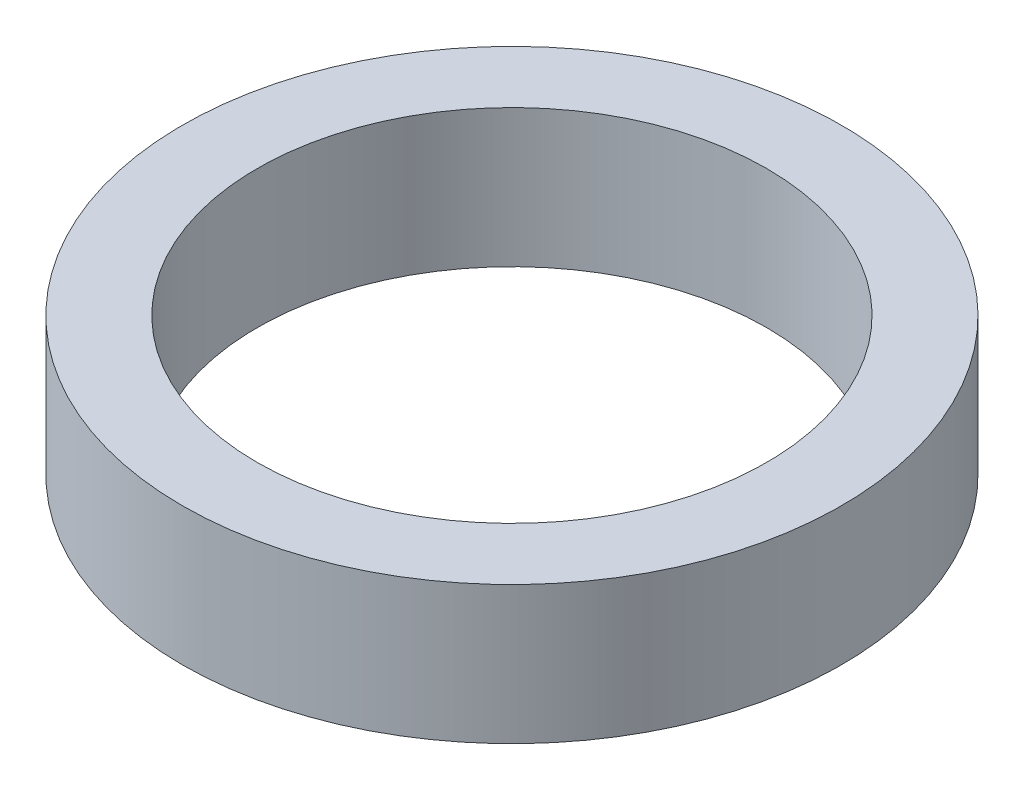
ISO-10303-21;
HEADER;
FILE_DESCRIPTION(('STEP AP214'),'2;1');
FILE_NAME('part.step','',(''),(''),'','','');
FILE_SCHEMA(('AUTOMOTIVE_DESIGN { 1 0 10303 214 1 1 1 1 }'));
ENDSEC;
DATA;
#1=APPLICATION_CONTEXT('core data for automotive mechanical design processes');
#2=APPLICATION_PROTOCOL_DEFINITION('international standard','automotive_design',2000,#1);
#3=PRODUCT_CONTEXT('',#1,'mechanical');
#4=PRODUCT('Part','Part','',(#3));
#5=PRODUCT_RELATED_PRODUCT_CATEGORY('part','',(#4));
#6=PRODUCT_DEFINITION_FORMATION('','',#4);
#7=PRODUCT_DEFINITION_CONTEXT('part definition',#1,'design');
#8=PRODUCT_DEFINITION('design','',#6,#7);
#9=PRODUCT_DEFINITION_SHAPE('','',#8);
#10=(LENGTH_UNIT() NAMED_UNIT(*) SI_UNIT(.MILLI.,.METRE.));
#11=(NAMED_UNIT(*) PLANE_ANGLE_UNIT() SI_UNIT($,.RADIAN.));
#12=(NAMED_UNIT(*) SI_UNIT($,.STERADIAN.) SOLID_ANGLE_UNIT());
#13=UNCERTAINTY_MEASURE_WITH_UNIT(LENGTH_MEASURE(1.E-05),#10,'distance_accuracy_value','');
#14=(GEOMETRIC_REPRESENTATION_CONTEXT(3) GLOBAL_UNCERTAINTY_ASSIGNED_CONTEXT((#13)) GLOBAL_UNIT_ASSIGNED_CONTEXT((#10,
#11,#12)) REPRESENTATION_CONTEXT('',''));
#15=CARTESIAN_POINT('',(0.,0.,0.));
#16=DIRECTION('',(0.,0.,1.));
#17=DIRECTION('',(1.,0.,0.));
#18=AXIS2_PLACEMENT_3D('',#15,#16,#17);
#19=CARTESIAN_POINT('',(0.,23.,0.));
#20=DIRECTION('',(0.,-1.,0.));
#21=DIRECTION('',(0.,0.,-1.));
#22=AXIS2_PLACEMENT_3D('',#19,#20,#21);
#23=CYLINDRICAL_SURFACE('',#22,55.);
#24=CARTESIAN_POINT('',(0.,23.,0.));
#25=DIRECTION('',(0.,1.,0.));
#26=DIRECTION('',(0.,0.,1.));
#27=AXIS2_PLACEMENT_3D('',#24,#25,#26);
#28=CIRCLE('',#27,55.);
#29=CARTESIAN_POINT('',(0.,23.,55.));
#30=VERTEX_POINT('',#29);
#31=EDGE_CURVE('E10',#30,#30,#28,.T.);
#32=ORIENTED_EDGE('',*,*,#31,.F.);
#33=EDGE_LOOP('',(#32));
#34=FACE_BOUND('',#33,.T.);
#35=CARTESIAN_POINT('',(0.,0.,0.));
#36=DIRECTION('',(0.,1.,0.));
#37=DIRECTION('',(0.,0.,1.));
#38=AXIS2_PLACEMENT_3D('',#35,#36,#37);
#39=CIRCLE('',#38,55.);
#40=CARTESIAN_POINT('',(0.,0.,55.));
#41=VERTEX_POINT('',#40);
#42=EDGE_CURVE('E37',#41,#41,#39,.T.);
#43=ORIENTED_EDGE('',*,*,#42,.T.);
#44=EDGE_LOOP('',(#43));
#45=FACE_BOUND('',#44,.T.);
#46=ADVANCED_FACE('F40',(#34,#45),#23,.T.);
#47=CARTESIAN_POINT('',(0.,23.,0.));
#48=DIRECTION('',(0.,1.,0.));
#49=DIRECTION('',(0.,0.,1.));
#50=AXIS2_PLACEMENT_3D('',#47,#48,#49);
#51=PLANE('',#50);
#52=CARTESIAN_POINT('',(0.,23.,0.));
#53=DIRECTION('',(0.,1.,0.));
#54=DIRECTION('',(0.,0.,1.));
#55=AXIS2_PLACEMENT_3D('',#52,#53,#54);
#56=CIRCLE('',#55,42.5);
#57=CARTESIAN_POINT('',(0.,23.,42.5));
#58=VERTEX_POINT('',#57);
#59=EDGE_CURVE('E50',#58,#58,#56,.T.);
#60=ORIENTED_EDGE('',*,*,#59,.F.);
#61=EDGE_LOOP('',(#60));
#62=FACE_BOUND('',#61,.T.);
#63=ORIENTED_EDGE('',*,*,#31,.T.);
#64=EDGE_LOOP('',(#63));
#65=FACE_BOUND('',#64,.T.);
#66=ADVANCED_FACE('F59',(#62,#65),#51,.T.);
#67=CARTESIAN_POINT('',(0.,0.,0.));
#68=DIRECTION('',(0.,1.,0.));
#69=DIRECTION('',(0.,0.,1.));
#70=AXIS2_PLACEMENT_3D('',#67,#68,#69);
#71=PLANE('',#70);
#72=CARTESIAN_POINT('',(0.,0.,0.));
#73=DIRECTION('',(0.,1.,0.));
#74=DIRECTION('',(0.,0.,1.));
#75=AXIS2_PLACEMENT_3D('',#72,#73,#74);
#76=CIRCLE('',#75,42.5);
#77=CARTESIAN_POINT('',(0.,0.,42.5));
#78=VERTEX_POINT('',#77);
#79=EDGE_CURVE('E47',#78,#78,#76,.T.);
#80=ORIENTED_EDGE('',*,*,#79,.T.);
#81=EDGE_LOOP('',(#80));
#82=FACE_BOUND('',#81,.T.);
#83=ORIENTED_EDGE('',*,*,#42,.F.);
#84=EDGE_LOOP('',(#83));
#85=FACE_BOUND('',#84,.T.);
#86=ADVANCED_FACE('F58',(#82,#85),#71,.F.);
#87=CARTESIAN_POINT('',(0.,23.,0.));
#88=DIRECTION('',(0.,-1.,0.));
#89=DIRECTION('',(0.,0.,-1.));
#90=AXIS2_PLACEMENT_3D('',#87,#88,#89);
#91=CYLINDRICAL_SURFACE('',#90,42.5);
#92=ORIENTED_EDGE('',*,*,#59,.T.);
#93=EDGE_LOOP('',(#92));
#94=FACE_BOUND('',#93,.T.);
#95=ORIENTED_EDGE('',*,*,#79,.F.);
#96=EDGE_LOOP('',(#95));
#97=FACE_BOUND('',#96,.T.);
#98=ADVANCED_FACE('F54',(#94,#97),#91,.F.);
#99=CLOSED_SHELL('',(#46,#66,#86,#98));
#100=MANIFOLD_SOLID_BREP('B2',#99);
#101=ADVANCED_BREP_SHAPE_REPRESENTATION('',(#18,#100),#14);
#102=SHAPE_DEFINITION_REPRESENTATION(#9,#101);
ENDSEC;
END-ISO-10303-21;
